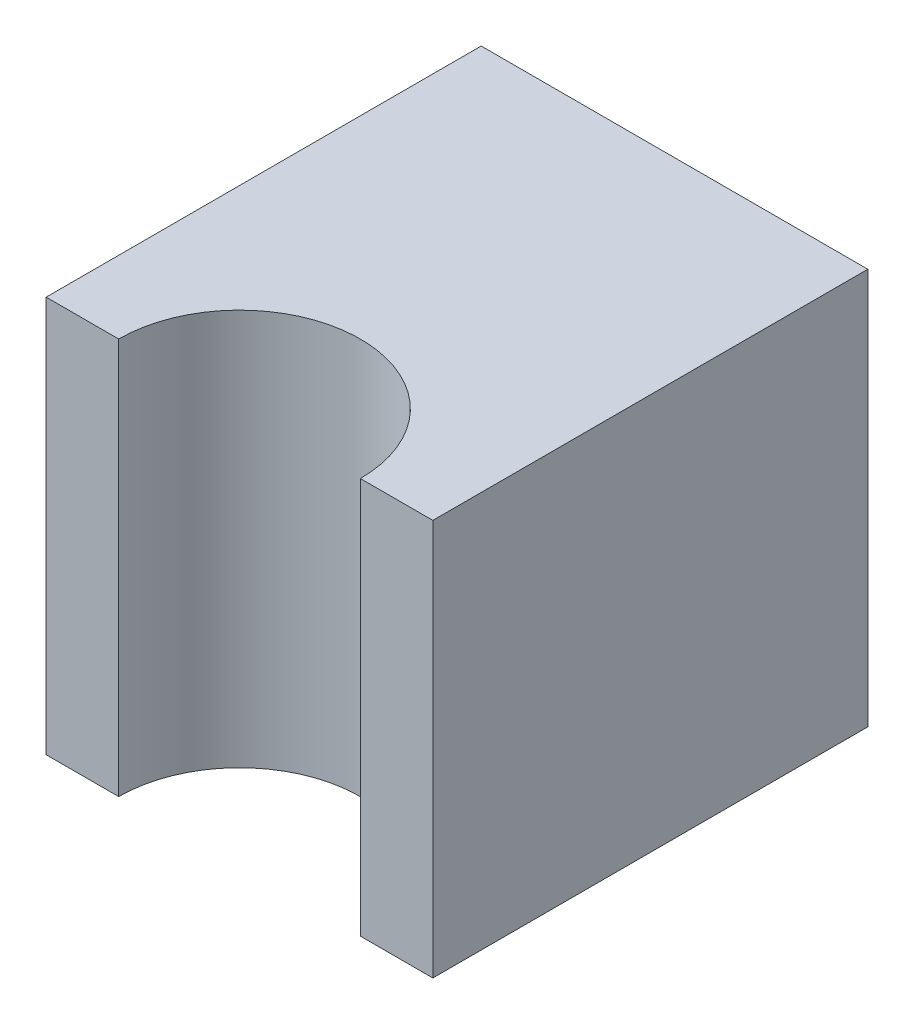
ISO-10303-21;
HEADER;
FILE_DESCRIPTION(('STEP AP214'),'2;1');
FILE_NAME('part.step','',(''),(''),'','','');
FILE_SCHEMA(('AUTOMOTIVE_DESIGN { 1 0 10303 214 1 1 1 1 }'));
ENDSEC;
DATA;
#1=APPLICATION_CONTEXT('core data for automotive mechanical design processes');
#2=APPLICATION_PROTOCOL_DEFINITION('international standard','automotive_design',2000,#1);
#3=PRODUCT_CONTEXT('',#1,'mechanical');
#4=PRODUCT('Part','Part','',(#3));
#5=PRODUCT_RELATED_PRODUCT_CATEGORY('part','',(#4));
#6=PRODUCT_DEFINITION_FORMATION('','',#4);
#7=PRODUCT_DEFINITION_CONTEXT('part definition',#1,'design');
#8=PRODUCT_DEFINITION('design','',#6,#7);
#9=PRODUCT_DEFINITION_SHAPE('','',#8);
#10=(LENGTH_UNIT() NAMED_UNIT(*) SI_UNIT(.MILLI.,.METRE.));
#11=(NAMED_UNIT(*) PLANE_ANGLE_UNIT() SI_UNIT($,.RADIAN.));
#12=(NAMED_UNIT(*) SI_UNIT($,.STERADIAN.) SOLID_ANGLE_UNIT());
#13=UNCERTAINTY_MEASURE_WITH_UNIT(LENGTH_MEASURE(1.E-05),#10,'distance_accuracy_value','');
#14=(GEOMETRIC_REPRESENTATION_CONTEXT(3) GLOBAL_UNCERTAINTY_ASSIGNED_CONTEXT((#13)) GLOBAL_UNIT_ASSIGNED_CONTEXT((#10,
#11,#12)) REPRESENTATION_CONTEXT('',''));
#15=CARTESIAN_POINT('',(0.,0.,0.));
#16=DIRECTION('',(0.,0.,1.));
#17=DIRECTION('',(1.,0.,0.));
#18=AXIS2_PLACEMENT_3D('',#15,#16,#17);
#19=CARTESIAN_POINT('',(-3.7,0.,6.1));
#20=DIRECTION('',(0.,1.,0.));
#21=DIRECTION('',(0.,0.,1.));
#22=AXIS2_PLACEMENT_3D('',#19,#20,#21);
#23=CYLINDRICAL_SURFACE('',#22,0.25);
#24=DIRECTION('',(0.,1.,0.));
#25=VECTOR('',#24,1.);
#26=CARTESIAN_POINT('',(-3.45,0.,6.1));
#27=LINE('',#26,#25);
#28=CARTESIAN_POINT('',(-3.45,0.82,6.1));
#29=VERTEX_POINT('',#28);
#30=CARTESIAN_POINT('',(-3.45,0.,6.1));
#31=VERTEX_POINT('',#30);
#32=EDGE_CURVE('E119',#29,#31,#27,.F.);
#33=ORIENTED_EDGE('',*,*,#32,.F.);
#34=CARTESIAN_POINT('',(-3.7,0.82,6.1));
#35=DIRECTION('',(0.,1.,0.));
#36=DIRECTION('',(0.,0.,1.));
#37=AXIS2_PLACEMENT_3D('',#34,#35,#36);
#38=CIRCLE('',#37,0.25);
#39=CARTESIAN_POINT('',(-3.95,0.82,6.1));
#40=VERTEX_POINT('',#39);
#41=EDGE_CURVE('E80',#40,#29,#38,.F.);
#42=ORIENTED_EDGE('',*,*,#41,.F.);
#43=DIRECTION('',(0.,1.,0.));
#44=VECTOR('',#43,1.);
#45=CARTESIAN_POINT('',(-3.95,0.,6.1));
#46=LINE('',#45,#44);
#47=CARTESIAN_POINT('',(-3.95,0.,6.1));
#48=VERTEX_POINT('',#47);
#49=EDGE_CURVE('E78',#48,#40,#46,.T.);
#50=ORIENTED_EDGE('',*,*,#49,.F.);
#51=CARTESIAN_POINT('',(-3.7,0.,6.1));
#52=DIRECTION('',(0.,1.,0.));
#53=DIRECTION('',(0.,0.,1.));
#54=AXIS2_PLACEMENT_3D('',#51,#52,#53);
#55=CIRCLE('',#54,0.25);
#56=EDGE_CURVE('E20',#48,#31,#55,.F.);
#57=ORIENTED_EDGE('',*,*,#56,.T.);
#58=EDGE_LOOP('',(#33,#42,#50,#57));
#59=FACE_BOUND('',#58,.T.);
#60=ADVANCED_FACE('F17',(#59),#23,.F.);
#61=CARTESIAN_POINT('',(-3.45,0.,6.1));
#62=DIRECTION('',(0.,0.,1.));
#63=DIRECTION('',(1.,0.,0.));
#64=AXIS2_PLACEMENT_3D('',#61,#62,#63);
#65=PLANE('',#64);
#66=DIRECTION('',(1.,0.,0.));
#67=VECTOR('',#66,1.);
#68=CARTESIAN_POINT('',(-3.7,0.82,6.1));
#69=LINE('',#68,#67);
#70=CARTESIAN_POINT('',(-3.3,0.82,6.1));
#71=VERTEX_POINT('',#70);
#72=EDGE_CURVE('E104',#29,#71,#69,.T.);
#73=ORIENTED_EDGE('',*,*,#72,.F.);
#74=ORIENTED_EDGE('',*,*,#32,.T.);
#75=DIRECTION('',(1.,0.,0.));
#76=VECTOR('',#75,1.);
#77=CARTESIAN_POINT('',(-3.7,0.,6.1));
#78=LINE('',#77,#76);
#79=CARTESIAN_POINT('',(-3.3,0.,6.1));
#80=VERTEX_POINT('',#79);
#81=EDGE_CURVE('E73',#31,#80,#78,.T.);
#82=ORIENTED_EDGE('',*,*,#81,.T.);
#83=DIRECTION('',(0.,1.,0.));
#84=VECTOR('',#83,1.);
#85=CARTESIAN_POINT('',(-3.3,0.,6.1));
#86=LINE('',#85,#84);
#87=EDGE_CURVE('E76',#71,#80,#86,.F.);
#88=ORIENTED_EDGE('',*,*,#87,.F.);
#89=EDGE_LOOP('',(#73,#74,#82,#88));
#90=FACE_BOUND('',#89,.T.);
#91=ADVANCED_FACE('F196',(#90),#65,.T.);
#92=CARTESIAN_POINT('',(-3.3,0.,6.1));
#93=DIRECTION('',(1.,0.,0.));
#94=DIRECTION('',(0.,0.,-1.));
#95=AXIS2_PLACEMENT_3D('',#92,#93,#94);
#96=PLANE('',#95);
#97=DIRECTION('',(0.,0.,1.));
#98=VECTOR('',#97,1.);
#99=CARTESIAN_POINT('',(-3.3,0.82,5.65));
#100=LINE('',#99,#98);
#101=CARTESIAN_POINT('',(-3.3,0.82,5.2));
#102=VERTEX_POINT('',#101);
#103=EDGE_CURVE('E83',#71,#102,#100,.F.);
#104=ORIENTED_EDGE('',*,*,#103,.F.);
#105=ORIENTED_EDGE('',*,*,#87,.T.);
#106=DIRECTION('',(0.,0.,1.));
#107=VECTOR('',#106,1.);
#108=CARTESIAN_POINT('',(-3.3,0.,5.65));
#109=LINE('',#108,#107);
#110=CARTESIAN_POINT('',(-3.3,0.,5.2));
#111=VERTEX_POINT('',#110);
#112=EDGE_CURVE('E89',#80,#111,#109,.F.);
#113=ORIENTED_EDGE('',*,*,#112,.T.);
#114=DIRECTION('',(0.,1.,0.));
#115=VECTOR('',#114,1.);
#116=CARTESIAN_POINT('',(-3.3,0.,5.2));
#117=LINE('',#116,#115);
#118=EDGE_CURVE('E100',#102,#111,#117,.F.);
#119=ORIENTED_EDGE('',*,*,#118,.F.);
#120=EDGE_LOOP('',(#104,#105,#113,#119));
#121=FACE_BOUND('',#120,.T.);
#122=ADVANCED_FACE('F187',(#121),#96,.T.);
#123=CARTESIAN_POINT('',(-3.7,0.,5.65));
#124=DIRECTION('',(0.,1.,0.));
#125=DIRECTION('',(0.,0.,1.));
#126=AXIS2_PLACEMENT_3D('',#123,#124,#125);
#127=PLANE('',#126);
#128=ORIENTED_EDGE('',*,*,#81,.F.);
#129=ORIENTED_EDGE('',*,*,#56,.F.);
#130=DIRECTION('',(1.,0.,0.));
#131=VECTOR('',#130,1.);
#132=CARTESIAN_POINT('',(-4.1,0.,6.1));
#133=LINE('',#132,#131);
#134=CARTESIAN_POINT('',(-4.1,0.,6.1));
#135=VERTEX_POINT('',#134);
#136=EDGE_CURVE('E70',#135,#48,#133,.T.);
#137=ORIENTED_EDGE('',*,*,#136,.F.);
#138=DIRECTION('',(0.,0.,1.));
#139=VECTOR('',#138,1.);
#140=CARTESIAN_POINT('',(-4.1,0.,5.2));
#141=LINE('',#140,#139);
#142=CARTESIAN_POINT('',(-4.1,0.,5.2));
#143=VERTEX_POINT('',#142);
#144=EDGE_CURVE('E98',#143,#135,#141,.T.);
#145=ORIENTED_EDGE('',*,*,#144,.F.);
#146=DIRECTION('',(-1.,0.,0.));
#147=VECTOR('',#146,1.);
#148=CARTESIAN_POINT('',(-3.3,0.,5.2));
#149=LINE('',#148,#147);
#150=EDGE_CURVE('E107',#111,#143,#149,.T.);
#151=ORIENTED_EDGE('',*,*,#150,.F.);
#152=ORIENTED_EDGE('',*,*,#112,.F.);
#153=EDGE_LOOP('',(#128,#129,#137,#145,#151,#152));
#154=FACE_BOUND('',#153,.T.);
#155=ADVANCED_FACE('F68',(#154),#127,.F.);
#156=CARTESIAN_POINT('',(-4.1,0.,6.1));
#157=DIRECTION('',(0.,0.,1.));
#158=DIRECTION('',(1.,0.,0.));
#159=AXIS2_PLACEMENT_3D('',#156,#157,#158);
#160=PLANE('',#159);
#161=DIRECTION('',(1.,0.,0.));
#162=VECTOR('',#161,1.);
#163=CARTESIAN_POINT('',(-3.7,0.82,6.1));
#164=LINE('',#163,#162);
#165=CARTESIAN_POINT('',(-4.1,0.82,6.1));
#166=VERTEX_POINT('',#165);
#167=EDGE_CURVE('E105',#166,#40,#164,.T.);
#168=ORIENTED_EDGE('',*,*,#167,.F.);
#169=DIRECTION('',(0.,1.,0.));
#170=VECTOR('',#169,1.);
#171=CARTESIAN_POINT('',(-4.1,0.,6.1));
#172=LINE('',#171,#170);
#173=EDGE_CURVE('E87',#135,#166,#172,.T.);
#174=ORIENTED_EDGE('',*,*,#173,.F.);
#175=ORIENTED_EDGE('',*,*,#136,.T.);
#176=ORIENTED_EDGE('',*,*,#49,.T.);
#177=EDGE_LOOP('',(#168,#174,#175,#176));
#178=FACE_BOUND('',#177,.T.);
#179=ADVANCED_FACE('F85',(#178),#160,.T.);
#180=CARTESIAN_POINT('',(-3.7,0.82,5.65));
#181=DIRECTION('',(0.,1.,0.));
#182=DIRECTION('',(0.,0.,1.));
#183=AXIS2_PLACEMENT_3D('',#180,#181,#182);
#184=PLANE('',#183);
#185=ORIENTED_EDGE('',*,*,#41,.T.);
#186=ORIENTED_EDGE('',*,*,#72,.T.);
#187=ORIENTED_EDGE('',*,*,#103,.T.);
#188=DIRECTION('',(-1.,0.,0.));
#189=VECTOR('',#188,1.);
#190=CARTESIAN_POINT('',(-3.3,0.82,5.2));
#191=LINE('',#190,#189);
#192=CARTESIAN_POINT('',(-4.1,0.82,5.2));
#193=VERTEX_POINT('',#192);
#194=EDGE_CURVE('E35',#193,#102,#191,.F.);
#195=ORIENTED_EDGE('',*,*,#194,.F.);
#196=DIRECTION('',(0.,0.,1.));
#197=VECTOR('',#196,1.);
#198=CARTESIAN_POINT('',(-4.1,0.82,5.2));
#199=LINE('',#198,#197);
#200=EDGE_CURVE('E26',#166,#193,#199,.F.);
#201=ORIENTED_EDGE('',*,*,#200,.F.);
#202=ORIENTED_EDGE('',*,*,#167,.T.);
#203=EDGE_LOOP('',(#185,#186,#187,#195,#201,#202));
#204=FACE_BOUND('',#203,.T.);
#205=ADVANCED_FACE('F145',(#204),#184,.T.);
#206=CARTESIAN_POINT('',(-3.3,0.,5.2));
#207=DIRECTION('',(0.,0.,-1.));
#208=DIRECTION('',(-1.,0.,0.));
#209=AXIS2_PLACEMENT_3D('',#206,#207,#208);
#210=PLANE('',#209);
#211=ORIENTED_EDGE('',*,*,#194,.T.);
#212=ORIENTED_EDGE('',*,*,#118,.T.);
#213=ORIENTED_EDGE('',*,*,#150,.T.);
#214=DIRECTION('',(0.,1.,0.));
#215=VECTOR('',#214,1.);
#216=CARTESIAN_POINT('',(-4.1,0.,5.2));
#217=LINE('',#216,#215);
#218=EDGE_CURVE('E11',#193,#143,#217,.F.);
#219=ORIENTED_EDGE('',*,*,#218,.F.);
#220=EDGE_LOOP('',(#211,#212,#213,#219));
#221=FACE_BOUND('',#220,.T.);
#222=ADVANCED_FACE('F141',(#221),#210,.T.);
#223=CARTESIAN_POINT('',(-4.1,0.,5.2));
#224=DIRECTION('',(-1.,0.,0.));
#225=DIRECTION('',(0.,0.,1.));
#226=AXIS2_PLACEMENT_3D('',#223,#224,#225);
#227=PLANE('',#226);
#228=ORIENTED_EDGE('',*,*,#200,.T.);
#229=ORIENTED_EDGE('',*,*,#218,.T.);
#230=ORIENTED_EDGE('',*,*,#144,.T.);
#231=ORIENTED_EDGE('',*,*,#173,.T.);
#232=EDGE_LOOP('',(#228,#229,#230,#231));
#233=FACE_BOUND('',#232,.T.);
#234=ADVANCED_FACE('F144',(#233),#227,.T.);
#235=CLOSED_SHELL('',(#60,#91,#122,#155,#179,#205,#222,#234));
#236=MANIFOLD_SOLID_BREP('B1',#235);
#237=ADVANCED_BREP_SHAPE_REPRESENTATION('',(#18,#236),#14);
#238=SHAPE_DEFINITION_REPRESENTATION(#9,#237);
ENDSEC;
END-ISO-10303-21;
